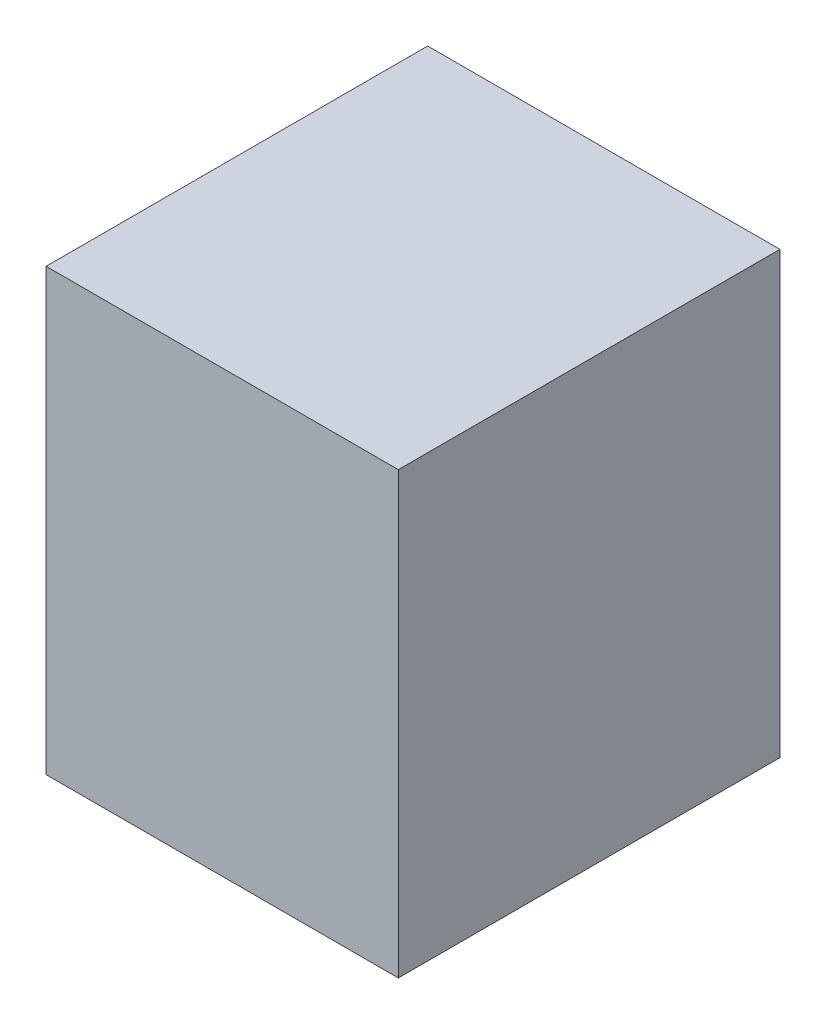
ISO-10303-21;
HEADER;
FILE_DESCRIPTION(('STEP AP214'),'2;1');
FILE_NAME('part.step','',(''),(''),'','','');
FILE_SCHEMA(('AUTOMOTIVE_DESIGN { 1 0 10303 214 1 1 1 1 }'));
ENDSEC;
DATA;
#1=APPLICATION_CONTEXT('core data for automotive mechanical design processes');
#2=APPLICATION_PROTOCOL_DEFINITION('international standard','automotive_design',2000,#1);
#3=PRODUCT_CONTEXT('',#1,'mechanical');
#4=PRODUCT('Part','Part','',(#3));
#5=PRODUCT_RELATED_PRODUCT_CATEGORY('part','',(#4));
#6=PRODUCT_DEFINITION_FORMATION('','',#4);
#7=PRODUCT_DEFINITION_CONTEXT('part definition',#1,'design');
#8=PRODUCT_DEFINITION('design','',#6,#7);
#9=PRODUCT_DEFINITION_SHAPE('','',#8);
#10=(LENGTH_UNIT() NAMED_UNIT(*) SI_UNIT(.MILLI.,.METRE.));
#11=(NAMED_UNIT(*) PLANE_ANGLE_UNIT() SI_UNIT($,.RADIAN.));
#12=(NAMED_UNIT(*) SI_UNIT($,.STERADIAN.) SOLID_ANGLE_UNIT());
#13=UNCERTAINTY_MEASURE_WITH_UNIT(LENGTH_MEASURE(1.E-05),#10,'distance_accuracy_value','');
#14=(GEOMETRIC_REPRESENTATION_CONTEXT(3) GLOBAL_UNCERTAINTY_ASSIGNED_CONTEXT((#13)) GLOBAL_UNIT_ASSIGNED_CONTEXT((#10,
#11,#12)) REPRESENTATION_CONTEXT('',''));
#15=CARTESIAN_POINT('',(0.,0.,0.));
#16=DIRECTION('',(0.,0.,1.));
#17=DIRECTION('',(1.,0.,0.));
#18=AXIS2_PLACEMENT_3D('',#15,#16,#17);
#19=CARTESIAN_POINT('',(-6.,-7.5,13.));
#20=DIRECTION('',(0.,1.,0.));
#21=DIRECTION('',(0.,0.,1.));
#22=AXIS2_PLACEMENT_3D('',#19,#20,#21);
#23=PLANE('',#22);
#24=DIRECTION('',(0.,0.,-1.));
#25=VECTOR('',#24,1.);
#26=CARTESIAN_POINT('',(5.05121444599866,-7.49999999999999,8.));
#27=LINE('',#26,#25);
#28=CARTESIAN_POINT('',(5.05121444599866,-7.49999999999999,8.));
#29=VERTEX_POINT('',#28);
#30=CARTESIAN_POINT('',(5.05121444599866,-7.49999999999999,0.));
#31=VERTEX_POINT('',#30);
#32=EDGE_CURVE('E173',#29,#31,#27,.T.);
#33=ORIENTED_EDGE('',*,*,#32,.T.);
#34=DIRECTION('',(1.,0.,0.));
#35=VECTOR('',#34,1.);
#36=CARTESIAN_POINT('',(-6.,-7.5,0.));
#37=LINE('',#36,#35);
#38=CARTESIAN_POINT('',(6.,-7.5,0.));
#39=VERTEX_POINT('',#38);
#40=EDGE_CURVE('E78',#31,#39,#37,.T.);
#41=ORIENTED_EDGE('',*,*,#40,.T.);
#42=DIRECTION('',(0.,0.,-1.));
#43=VECTOR('',#42,1.);
#44=CARTESIAN_POINT('',(6.,-7.5,13.));
#45=LINE('',#44,#43);
#46=CARTESIAN_POINT('',(6.,-7.5,13.));
#47=VERTEX_POINT('',#46);
#48=EDGE_CURVE('E195',#47,#39,#45,.T.);
#49=ORIENTED_EDGE('',*,*,#48,.F.);
#50=DIRECTION('',(1.,0.,0.));
#51=VECTOR('',#50,1.);
#52=CARTESIAN_POINT('',(-6.,-7.5,13.));
#53=LINE('',#52,#51);
#54=CARTESIAN_POINT('',(-6.,-7.5,13.));
#55=VERTEX_POINT('',#54);
#56=EDGE_CURVE('E57',#55,#47,#53,.T.);
#57=ORIENTED_EDGE('',*,*,#56,.F.);
#58=DIRECTION('',(0.,0.,-1.));
#59=VECTOR('',#58,1.);
#60=CARTESIAN_POINT('',(-6.,-7.5,13.));
#61=LINE('',#60,#59);
#62=CARTESIAN_POINT('',(-6.,-7.5,0.));
#63=VERTEX_POINT('',#62);
#64=EDGE_CURVE('E203',#55,#63,#61,.T.);
#65=ORIENTED_EDGE('',*,*,#64,.T.);
#66=CARTESIAN_POINT('',(-5.05121444599865,-7.5,0.));
#67=VERTEX_POINT('',#66);
#68=EDGE_CURVE('E191',#63,#67,#37,.T.);
#69=ORIENTED_EDGE('',*,*,#68,.T.);
#70=DIRECTION('',(0.,0.,-1.));
#71=VECTOR('',#70,1.);
#72=CARTESIAN_POINT('',(-5.05121444599865,-7.5,8.));
#73=LINE('',#72,#71);
#74=CARTESIAN_POINT('',(-5.05121444599865,-7.5,8.));
#75=VERTEX_POINT('',#74);
#76=EDGE_CURVE('E48',#75,#67,#73,.T.);
#77=ORIENTED_EDGE('',*,*,#76,.F.);
#78=DIRECTION('',(1.,0.,0.));
#79=VECTOR('',#78,1.);
#80=CARTESIAN_POINT('',(-5.05121444599865,-7.5,8.));
#81=LINE('',#80,#79);
#82=EDGE_CURVE('E245',#75,#29,#81,.T.);
#83=ORIENTED_EDGE('',*,*,#82,.T.);
#84=EDGE_LOOP('',(#33,#41,#49,#57,#65,#69,#77,#83));
#85=FACE_BOUND('',#84,.T.);
#86=ADVANCED_FACE('F33',(#85),#23,.F.);
#87=CARTESIAN_POINT('',(0.,0.,0.));
#88=DIRECTION('',(0.,0.,1.));
#89=DIRECTION('',(1.,0.,0.));
#90=AXIS2_PLACEMENT_3D('',#87,#88,#89);
#91=PLANE('',#90);
#92=DIRECTION('',(0.,1.,0.));
#93=VECTOR('',#92,1.);
#94=CARTESIAN_POINT('',(5.05121444599865,4.19782395760038,0.));
#95=LINE('',#94,#93);
#96=CARTESIAN_POINT('',(5.05121444599865,4.19782395760038,0.));
#97=VERTEX_POINT('',#96);
#98=EDGE_CURVE('E239',#31,#97,#95,.T.);
#99=ORIENTED_EDGE('',*,*,#98,.T.);
#100=DIRECTION('',(-1.,0.,0.));
#101=VECTOR('',#100,1.);
#102=CARTESIAN_POINT('',(2.94980673245959,4.19782395760038,0.));
#103=LINE('',#102,#101);
#104=CARTESIAN_POINT('',(2.94980673245959,4.19782395760038,0.));
#105=VERTEX_POINT('',#104);
#106=EDGE_CURVE('E178',#97,#105,#103,.T.);
#107=ORIENTED_EDGE('',*,*,#106,.T.);
#108=DIRECTION('',(0.,1.,0.));
#109=VECTOR('',#108,1.);
#110=CARTESIAN_POINT('',(2.94980673245959,5.67403113452869,0.));
#111=LINE('',#110,#109);
#112=CARTESIAN_POINT('',(2.94980673245959,5.67403113452869,0.));
#113=VERTEX_POINT('',#112);
#114=EDGE_CURVE('E242',#105,#113,#111,.T.);
#115=ORIENTED_EDGE('',*,*,#114,.T.);
#116=DIRECTION('',(-1.,0.,0.));
#117=VECTOR('',#116,1.);
#118=CARTESIAN_POINT('',(1.33126831185848,5.67403113452869,0.));
#119=LINE('',#118,#117);
#120=CARTESIAN_POINT('',(1.33126831185848,5.67403113452869,0.));
#121=VERTEX_POINT('',#120);
#122=EDGE_CURVE('E249',#113,#121,#119,.T.);
#123=ORIENTED_EDGE('',*,*,#122,.T.);
#124=DIRECTION('',(0.,1.,0.));
#125=VECTOR('',#124,1.);
#126=CARTESIAN_POINT('',(1.33126831185848,6.43495231548741,0.));
#127=LINE('',#126,#125);
#128=CARTESIAN_POINT('',(1.33126831185848,6.43495231548741,0.));
#129=VERTEX_POINT('',#128);
#130=EDGE_CURVE('E252',#121,#129,#127,.T.);
#131=ORIENTED_EDGE('',*,*,#130,.T.);
#132=DIRECTION('',(-1.,0.,0.));
#133=VECTOR('',#132,1.);
#134=CARTESIAN_POINT('',(1.33126831185848,6.43495231548741,0.));
#135=LINE('',#134,#133);
#136=CARTESIAN_POINT('',(-1.33126831185848,6.43495231548741,0.));
#137=VERTEX_POINT('',#136);
#138=EDGE_CURVE('E255',#129,#137,#135,.T.);
#139=ORIENTED_EDGE('',*,*,#138,.T.);
#140=DIRECTION('',(0.,-1.,0.));
#141=VECTOR('',#140,1.);
#142=CARTESIAN_POINT('',(-1.33126831185848,6.43495231548741,0.));
#143=LINE('',#142,#141);
#144=CARTESIAN_POINT('',(-1.33126831185848,5.67403113452869,0.));
#145=VERTEX_POINT('',#144);
#146=EDGE_CURVE('E258',#137,#145,#143,.T.);
#147=ORIENTED_EDGE('',*,*,#146,.T.);
#148=DIRECTION('',(-1.,0.,0.));
#149=VECTOR('',#148,1.);
#150=CARTESIAN_POINT('',(-1.33126831185848,5.67403113452869,0.));
#151=LINE('',#150,#149);
#152=CARTESIAN_POINT('',(-2.94980673245959,5.67403113452869,0.));
#153=VERTEX_POINT('',#152);
#154=EDGE_CURVE('E261',#145,#153,#151,.T.);
#155=ORIENTED_EDGE('',*,*,#154,.T.);
#156=DIRECTION('',(0.,-1.,0.));
#157=VECTOR('',#156,1.);
#158=CARTESIAN_POINT('',(-2.94980673245959,5.67403113452869,0.));
#159=LINE('',#158,#157);
#160=CARTESIAN_POINT('',(-2.94980673245959,4.19782395760038,0.));
#161=VERTEX_POINT('',#160);
#162=EDGE_CURVE('E264',#153,#161,#159,.T.);
#163=ORIENTED_EDGE('',*,*,#162,.T.);
#164=DIRECTION('',(-1.,0.,0.));
#165=VECTOR('',#164,1.);
#166=CARTESIAN_POINT('',(-2.94980673245959,4.19782395760038,0.));
#167=LINE('',#166,#165);
#168=CARTESIAN_POINT('',(-5.05121444599865,4.19782395760038,0.));
#169=VERTEX_POINT('',#168);
#170=EDGE_CURVE('E267',#161,#169,#167,.T.);
#171=ORIENTED_EDGE('',*,*,#170,.T.);
#172=DIRECTION('',(0.,-1.,0.));
#173=VECTOR('',#172,1.);
#174=CARTESIAN_POINT('',(-5.05121444599865,4.19782395760038,0.));
#175=LINE('',#174,#173);
#176=EDGE_CURVE('E174',#169,#67,#175,.T.);
#177=ORIENTED_EDGE('',*,*,#176,.T.);
#178=ORIENTED_EDGE('',*,*,#68,.F.);
#179=DIRECTION('',(0.,-1.,0.));
#180=VECTOR('',#179,1.);
#181=CARTESIAN_POINT('',(-6.,7.5,0.));
#182=LINE('',#181,#180);
#183=CARTESIAN_POINT('',(-6.,7.5,0.));
#184=VERTEX_POINT('',#183);
#185=EDGE_CURVE('E198',#184,#63,#182,.T.);
#186=ORIENTED_EDGE('',*,*,#185,.F.);
#187=DIRECTION('',(-1.,0.,0.));
#188=VECTOR('',#187,1.);
#189=CARTESIAN_POINT('',(-6.,7.5,0.));
#190=LINE('',#189,#188);
#191=CARTESIAN_POINT('',(6.,7.5,0.));
#192=VERTEX_POINT('',#191);
#193=EDGE_CURVE('E183',#192,#184,#190,.T.);
#194=ORIENTED_EDGE('',*,*,#193,.F.);
#195=DIRECTION('',(0.,1.,0.));
#196=VECTOR('',#195,1.);
#197=CARTESIAN_POINT('',(6.,7.5,0.));
#198=LINE('',#197,#196);
#199=EDGE_CURVE('E179',#39,#192,#198,.T.);
#200=ORIENTED_EDGE('',*,*,#199,.F.);
#201=ORIENTED_EDGE('',*,*,#40,.F.);
#202=EDGE_LOOP('',(#99,#107,#115,#123,#131,#139,#147,#155,#163,#171,#177,#178,#186,#194,#200,#201));
#203=FACE_BOUND('',#202,.T.);
#204=ADVANCED_FACE('F213',(#203),#91,.F.);
#205=CARTESIAN_POINT('',(6.,7.5,13.));
#206=DIRECTION('',(-1.,0.,0.));
#207=DIRECTION('',(0.,-1.,0.));
#208=AXIS2_PLACEMENT_3D('',#205,#206,#207);
#209=PLANE('',#208);
#210=ORIENTED_EDGE('',*,*,#199,.T.);
#211=DIRECTION('',(0.,0.,-1.));
#212=VECTOR('',#211,1.);
#213=CARTESIAN_POINT('',(6.,7.5,13.));
#214=LINE('',#213,#212);
#215=CARTESIAN_POINT('',(6.,7.5,13.));
#216=VERTEX_POINT('',#215);
#217=EDGE_CURVE('E11',#216,#192,#214,.T.);
#218=ORIENTED_EDGE('',*,*,#217,.F.);
#219=DIRECTION('',(0.,1.,0.));
#220=VECTOR('',#219,1.);
#221=CARTESIAN_POINT('',(6.,7.5,13.));
#222=LINE('',#221,#220);
#223=EDGE_CURVE('E189',#47,#216,#222,.T.);
#224=ORIENTED_EDGE('',*,*,#223,.F.);
#225=ORIENTED_EDGE('',*,*,#48,.T.);
#226=EDGE_LOOP('',(#210,#218,#224,#225));
#227=FACE_BOUND('',#226,.T.);
#228=ADVANCED_FACE('F35',(#227),#209,.F.);
#229=CARTESIAN_POINT('',(-6.,7.5,13.));
#230=DIRECTION('',(0.,-1.,0.));
#231=DIRECTION('',(0.,0.,-1.));
#232=AXIS2_PLACEMENT_3D('',#229,#230,#231);
#233=PLANE('',#232);
#234=ORIENTED_EDGE('',*,*,#193,.T.);
#235=DIRECTION('',(0.,0.,-1.));
#236=VECTOR('',#235,1.);
#237=CARTESIAN_POINT('',(-6.,7.5,13.));
#238=LINE('',#237,#236);
#239=CARTESIAN_POINT('',(-6.,7.5,13.));
#240=VERTEX_POINT('',#239);
#241=EDGE_CURVE('E41',#240,#184,#238,.T.);
#242=ORIENTED_EDGE('',*,*,#241,.F.);
#243=DIRECTION('',(-1.,0.,0.));
#244=VECTOR('',#243,1.);
#245=CARTESIAN_POINT('',(-6.,7.5,13.));
#246=LINE('',#245,#244);
#247=EDGE_CURVE('E85',#216,#240,#246,.T.);
#248=ORIENTED_EDGE('',*,*,#247,.F.);
#249=ORIENTED_EDGE('',*,*,#217,.T.);
#250=EDGE_LOOP('',(#234,#242,#248,#249));
#251=FACE_BOUND('',#250,.T.);
#252=ADVANCED_FACE('F227',(#251),#233,.F.);
#253=CARTESIAN_POINT('',(-6.,7.5,13.));
#254=DIRECTION('',(1.,0.,0.));
#255=DIRECTION('',(0.,1.,0.));
#256=AXIS2_PLACEMENT_3D('',#253,#254,#255);
#257=PLANE('',#256);
#258=ORIENTED_EDGE('',*,*,#185,.T.);
#259=ORIENTED_EDGE('',*,*,#64,.F.);
#260=DIRECTION('',(0.,-1.,0.));
#261=VECTOR('',#260,1.);
#262=CARTESIAN_POINT('',(-6.,7.5,13.));
#263=LINE('',#262,#261);
#264=EDGE_CURVE('E193',#240,#55,#263,.T.);
#265=ORIENTED_EDGE('',*,*,#264,.F.);
#266=ORIENTED_EDGE('',*,*,#241,.T.);
#267=EDGE_LOOP('',(#258,#259,#265,#266));
#268=FACE_BOUND('',#267,.T.);
#269=ADVANCED_FACE('F209',(#268),#257,.F.);
#270=CARTESIAN_POINT('',(0.,0.,13.));
#271=DIRECTION('',(0.,0.,1.));
#272=DIRECTION('',(1.,0.,0.));
#273=AXIS2_PLACEMENT_3D('',#270,#271,#272);
#274=PLANE('',#273);
#275=ORIENTED_EDGE('',*,*,#223,.T.);
#276=ORIENTED_EDGE('',*,*,#247,.T.);
#277=ORIENTED_EDGE('',*,*,#264,.T.);
#278=ORIENTED_EDGE('',*,*,#56,.T.);
#279=EDGE_LOOP('',(#275,#276,#277,#278));
#280=FACE_BOUND('',#279,.T.);
#281=ADVANCED_FACE('F219',(#280),#274,.T.);
#282=CARTESIAN_POINT('',(5.05121444599865,4.19782395760038,8.));
#283=DIRECTION('',(-1.,0.,0.));
#284=DIRECTION('',(0.,-1.,0.));
#285=AXIS2_PLACEMENT_3D('',#282,#283,#284);
#286=PLANE('',#285);
#287=ORIENTED_EDGE('',*,*,#98,.F.);
#288=ORIENTED_EDGE('',*,*,#32,.F.);
#289=DIRECTION('',(0.,1.,0.));
#290=VECTOR('',#289,1.);
#291=CARTESIAN_POINT('',(5.05121444599865,4.19782395760038,8.));
#292=LINE('',#291,#290);
#293=CARTESIAN_POINT('',(5.05121444599865,4.19782395760038,8.));
#294=VERTEX_POINT('',#293);
#295=EDGE_CURVE('E160',#29,#294,#292,.T.);
#296=ORIENTED_EDGE('',*,*,#295,.T.);
#297=DIRECTION('',(0.,0.,-1.));
#298=VECTOR('',#297,1.);
#299=CARTESIAN_POINT('',(5.05121444599865,4.19782395760038,8.));
#300=LINE('',#299,#298);
#301=EDGE_CURVE('E171',#294,#97,#300,.T.);
#302=ORIENTED_EDGE('',*,*,#301,.T.);
#303=EDGE_LOOP('',(#287,#288,#296,#302));
#304=FACE_BOUND('',#303,.T.);
#305=ADVANCED_FACE('F170',(#304),#286,.T.);
#306=CARTESIAN_POINT('',(2.94980673245959,4.19782395760038,8.));
#307=DIRECTION('',(0.,-1.,0.));
#308=DIRECTION('',(0.,0.,-1.));
#309=AXIS2_PLACEMENT_3D('',#306,#307,#308);
#310=PLANE('',#309);
#311=ORIENTED_EDGE('',*,*,#106,.F.);
#312=ORIENTED_EDGE('',*,*,#301,.F.);
#313=DIRECTION('',(-1.,0.,0.));
#314=VECTOR('',#313,1.);
#315=CARTESIAN_POINT('',(2.94980673245959,4.19782395760038,8.));
#316=LINE('',#315,#314);
#317=CARTESIAN_POINT('',(2.94980673245959,4.19782395760038,8.));
#318=VERTEX_POINT('',#317);
#319=EDGE_CURVE('E156',#294,#318,#316,.T.);
#320=ORIENTED_EDGE('',*,*,#319,.T.);
#321=DIRECTION('',(0.,0.,-1.));
#322=VECTOR('',#321,1.);
#323=CARTESIAN_POINT('',(2.94980673245959,4.19782395760038,8.));
#324=LINE('',#323,#322);
#325=EDGE_CURVE('E180',#318,#105,#324,.T.);
#326=ORIENTED_EDGE('',*,*,#325,.T.);
#327=EDGE_LOOP('',(#311,#312,#320,#326));
#328=FACE_BOUND('',#327,.T.);
#329=ADVANCED_FACE('F176',(#328),#310,.T.);
#330=CARTESIAN_POINT('',(2.94980673245959,5.67403113452869,8.));
#331=DIRECTION('',(-1.,0.,0.));
#332=DIRECTION('',(0.,-1.,0.));
#333=AXIS2_PLACEMENT_3D('',#330,#331,#332);
#334=PLANE('',#333);
#335=ORIENTED_EDGE('',*,*,#114,.F.);
#336=ORIENTED_EDGE('',*,*,#325,.F.);
#337=DIRECTION('',(0.,1.,0.));
#338=VECTOR('',#337,1.);
#339=CARTESIAN_POINT('',(2.94980673245959,5.67403113452869,8.));
#340=LINE('',#339,#338);
#341=CARTESIAN_POINT('',(2.94980673245959,5.67403113452869,8.));
#342=VERTEX_POINT('',#341);
#343=EDGE_CURVE('E163',#318,#342,#340,.T.);
#344=ORIENTED_EDGE('',*,*,#343,.T.);
#345=DIRECTION('',(0.,0.,-1.));
#346=VECTOR('',#345,1.);
#347=CARTESIAN_POINT('',(2.94980673245959,5.67403113452869,8.));
#348=LINE('',#347,#346);
#349=EDGE_CURVE('E185',#342,#113,#348,.T.);
#350=ORIENTED_EDGE('',*,*,#349,.T.);
#351=EDGE_LOOP('',(#335,#336,#344,#350));
#352=FACE_BOUND('',#351,.T.);
#353=ADVANCED_FACE('F289',(#352),#334,.T.);
#354=CARTESIAN_POINT('',(1.33126831185848,5.67403113452869,8.));
#355=DIRECTION('',(0.,-1.,0.));
#356=DIRECTION('',(0.,0.,-1.));
#357=AXIS2_PLACEMENT_3D('',#354,#355,#356);
#358=PLANE('',#357);
#359=ORIENTED_EDGE('',*,*,#122,.F.);
#360=ORIENTED_EDGE('',*,*,#349,.F.);
#361=DIRECTION('',(-1.,0.,0.));
#362=VECTOR('',#361,1.);
#363=CARTESIAN_POINT('',(1.33126831185848,5.67403113452869,8.));
#364=LINE('',#363,#362);
#365=CARTESIAN_POINT('',(1.33126831185848,5.67403113452869,8.));
#366=VERTEX_POINT('',#365);
#367=EDGE_CURVE('E463',#342,#366,#364,.T.);
#368=ORIENTED_EDGE('',*,*,#367,.T.);
#369=DIRECTION('',(0.,0.,-1.));
#370=VECTOR('',#369,1.);
#371=CARTESIAN_POINT('',(1.33126831185848,5.67403113452869,8.));
#372=LINE('',#371,#370);
#373=EDGE_CURVE('E284',#366,#121,#372,.T.);
#374=ORIENTED_EDGE('',*,*,#373,.T.);
#375=EDGE_LOOP('',(#359,#360,#368,#374));
#376=FACE_BOUND('',#375,.T.);
#377=ADVANCED_FACE('F291',(#376),#358,.T.);
#378=CARTESIAN_POINT('',(1.33126831185848,6.43495231548741,8.));
#379=DIRECTION('',(-1.,0.,0.));
#380=DIRECTION('',(0.,0.,1.));
#381=AXIS2_PLACEMENT_3D('',#378,#379,#380);
#382=PLANE('',#381);
#383=ORIENTED_EDGE('',*,*,#130,.F.);
#384=ORIENTED_EDGE('',*,*,#373,.F.);
#385=DIRECTION('',(0.,1.,0.));
#386=VECTOR('',#385,1.);
#387=CARTESIAN_POINT('',(1.33126831185848,6.43495231548741,8.));
#388=LINE('',#387,#386);
#389=CARTESIAN_POINT('',(1.33126831185848,6.43495231548741,8.));
#390=VERTEX_POINT('',#389);
#391=EDGE_CURVE('E299',#366,#390,#388,.T.);
#392=ORIENTED_EDGE('',*,*,#391,.T.);
#393=DIRECTION('',(0.,0.,-1.));
#394=VECTOR('',#393,1.);
#395=CARTESIAN_POINT('',(1.33126831185848,6.43495231548741,8.));
#396=LINE('',#395,#394);
#397=EDGE_CURVE('E282',#390,#129,#396,.T.);
#398=ORIENTED_EDGE('',*,*,#397,.T.);
#399=EDGE_LOOP('',(#383,#384,#392,#398));
#400=FACE_BOUND('',#399,.T.);
#401=ADVANCED_FACE('F296',(#400),#382,.T.);
#402=CARTESIAN_POINT('',(1.33126831185848,6.43495231548741,8.));
#403=DIRECTION('',(0.,-1.,0.));
#404=DIRECTION('',(0.,0.,-1.));
#405=AXIS2_PLACEMENT_3D('',#402,#403,#404);
#406=PLANE('',#405);
#407=ORIENTED_EDGE('',*,*,#138,.F.);
#408=ORIENTED_EDGE('',*,*,#397,.F.);
#409=DIRECTION('',(-1.,0.,0.));
#410=VECTOR('',#409,1.);
#411=CARTESIAN_POINT('',(1.33126831185848,6.43495231548741,8.));
#412=LINE('',#411,#410);
#413=CARTESIAN_POINT('',(-1.33126831185848,6.43495231548741,8.));
#414=VERTEX_POINT('',#413);
#415=EDGE_CURVE('E305',#390,#414,#412,.T.);
#416=ORIENTED_EDGE('',*,*,#415,.T.);
#417=DIRECTION('',(0.,0.,-1.));
#418=VECTOR('',#417,1.);
#419=CARTESIAN_POINT('',(-1.33126831185848,6.43495231548741,8.));
#420=LINE('',#419,#418);
#421=EDGE_CURVE('E280',#414,#137,#420,.T.);
#422=ORIENTED_EDGE('',*,*,#421,.T.);
#423=EDGE_LOOP('',(#407,#408,#416,#422));
#424=FACE_BOUND('',#423,.T.);
#425=ADVANCED_FACE('F302',(#424),#406,.T.);
#426=CARTESIAN_POINT('',(-1.33126831185848,6.43495231548741,8.));
#427=DIRECTION('',(1.,0.,0.));
#428=DIRECTION('',(0.,0.,-1.));
#429=AXIS2_PLACEMENT_3D('',#426,#427,#428);
#430=PLANE('',#429);
#431=ORIENTED_EDGE('',*,*,#146,.F.);
#432=ORIENTED_EDGE('',*,*,#421,.F.);
#433=DIRECTION('',(0.,-1.,0.));
#434=VECTOR('',#433,1.);
#435=CARTESIAN_POINT('',(-1.33126831185848,6.43495231548741,8.));
#436=LINE('',#435,#434);
#437=CARTESIAN_POINT('',(-1.33126831185848,5.67403113452869,8.));
#438=VERTEX_POINT('',#437);
#439=EDGE_CURVE('E459',#414,#438,#436,.T.);
#440=ORIENTED_EDGE('',*,*,#439,.T.);
#441=DIRECTION('',(0.,0.,-1.));
#442=VECTOR('',#441,1.);
#443=CARTESIAN_POINT('',(-1.33126831185848,5.67403113452869,8.));
#444=LINE('',#443,#442);
#445=EDGE_CURVE('E278',#438,#145,#444,.T.);
#446=ORIENTED_EDGE('',*,*,#445,.T.);
#447=EDGE_LOOP('',(#431,#432,#440,#446));
#448=FACE_BOUND('',#447,.T.);
#449=ADVANCED_FACE('F308',(#448),#430,.T.);
#450=CARTESIAN_POINT('',(-1.33126831185848,5.67403113452869,8.));
#451=DIRECTION('',(0.,-1.,0.));
#452=DIRECTION('',(0.,0.,-1.));
#453=AXIS2_PLACEMENT_3D('',#450,#451,#452);
#454=PLANE('',#453);
#455=ORIENTED_EDGE('',*,*,#154,.F.);
#456=ORIENTED_EDGE('',*,*,#445,.F.);
#457=DIRECTION('',(-1.,0.,0.));
#458=VECTOR('',#457,1.);
#459=CARTESIAN_POINT('',(-1.33126831185848,5.67403113452869,8.));
#460=LINE('',#459,#458);
#461=CARTESIAN_POINT('',(-2.94980673245959,5.67403113452869,8.));
#462=VERTEX_POINT('',#461);
#463=EDGE_CURVE('E316',#438,#462,#460,.T.);
#464=ORIENTED_EDGE('',*,*,#463,.T.);
#465=DIRECTION('',(0.,0.,-1.));
#466=VECTOR('',#465,1.);
#467=CARTESIAN_POINT('',(-2.94980673245959,5.67403113452869,8.));
#468=LINE('',#467,#466);
#469=EDGE_CURVE('E276',#462,#153,#468,.T.);
#470=ORIENTED_EDGE('',*,*,#469,.T.);
#471=EDGE_LOOP('',(#455,#456,#464,#470));
#472=FACE_BOUND('',#471,.T.);
#473=ADVANCED_FACE('F313',(#472),#454,.T.);
#474=CARTESIAN_POINT('',(-2.94980673245959,5.67403113452869,8.));
#475=DIRECTION('',(1.,0.,0.));
#476=DIRECTION('',(0.,0.,-1.));
#477=AXIS2_PLACEMENT_3D('',#474,#475,#476);
#478=PLANE('',#477);
#479=ORIENTED_EDGE('',*,*,#162,.F.);
#480=ORIENTED_EDGE('',*,*,#469,.F.);
#481=DIRECTION('',(0.,-1.,0.));
#482=VECTOR('',#481,1.);
#483=CARTESIAN_POINT('',(-2.94980673245959,5.67403113452869,8.));
#484=LINE('',#483,#482);
#485=CARTESIAN_POINT('',(-2.94980673245959,4.19782395760038,8.));
#486=VERTEX_POINT('',#485);
#487=EDGE_CURVE('E322',#462,#486,#484,.T.);
#488=ORIENTED_EDGE('',*,*,#487,.T.);
#489=DIRECTION('',(0.,0.,-1.));
#490=VECTOR('',#489,1.);
#491=CARTESIAN_POINT('',(-2.94980673245959,4.19782395760038,8.));
#492=LINE('',#491,#490);
#493=EDGE_CURVE('E274',#486,#161,#492,.T.);
#494=ORIENTED_EDGE('',*,*,#493,.T.);
#495=EDGE_LOOP('',(#479,#480,#488,#494));
#496=FACE_BOUND('',#495,.T.);
#497=ADVANCED_FACE('F319',(#496),#478,.T.);
#498=CARTESIAN_POINT('',(-2.94980673245959,4.19782395760038,8.));
#499=DIRECTION('',(0.,-1.,0.));
#500=DIRECTION('',(0.,0.,-1.));
#501=AXIS2_PLACEMENT_3D('',#498,#499,#500);
#502=PLANE('',#501);
#503=ORIENTED_EDGE('',*,*,#170,.F.);
#504=ORIENTED_EDGE('',*,*,#493,.F.);
#505=DIRECTION('',(-1.,0.,0.));
#506=VECTOR('',#505,1.);
#507=CARTESIAN_POINT('',(-2.94980673245959,4.19782395760038,8.));
#508=LINE('',#507,#506);
#509=CARTESIAN_POINT('',(-5.05121444599865,4.19782395760038,8.));
#510=VERTEX_POINT('',#509);
#511=EDGE_CURVE('E327',#486,#510,#508,.T.);
#512=ORIENTED_EDGE('',*,*,#511,.T.);
#513=DIRECTION('',(0.,0.,-1.));
#514=VECTOR('',#513,1.);
#515=CARTESIAN_POINT('',(-5.05121444599865,4.19782395760038,8.));
#516=LINE('',#515,#514);
#517=EDGE_CURVE('E272',#510,#169,#516,.T.);
#518=ORIENTED_EDGE('',*,*,#517,.T.);
#519=EDGE_LOOP('',(#503,#504,#512,#518));
#520=FACE_BOUND('',#519,.T.);
#521=ADVANCED_FACE('F325',(#520),#502,.T.);
#522=CARTESIAN_POINT('',(-5.05121444599865,4.19782395760038,8.));
#523=DIRECTION('',(1.,0.,0.));
#524=DIRECTION('',(0.,0.,-1.));
#525=AXIS2_PLACEMENT_3D('',#522,#523,#524);
#526=PLANE('',#525);
#527=ORIENTED_EDGE('',*,*,#176,.F.);
#528=ORIENTED_EDGE('',*,*,#517,.F.);
#529=DIRECTION('',(0.,-1.,0.));
#530=VECTOR('',#529,1.);
#531=CARTESIAN_POINT('',(-5.05121444599865,4.19782395760038,8.));
#532=LINE('',#531,#530);
#533=EDGE_CURVE('E454',#510,#75,#532,.T.);
#534=ORIENTED_EDGE('',*,*,#533,.T.);
#535=ORIENTED_EDGE('',*,*,#76,.T.);
#536=EDGE_LOOP('',(#527,#528,#534,#535));
#537=FACE_BOUND('',#536,.T.);
#538=ADVANCED_FACE('F329',(#537),#526,.T.);
#539=CARTESIAN_POINT('',(0.,0.,8.));
#540=DIRECTION('',(0.,0.,1.));
#541=DIRECTION('',(1.,0.,0.));
#542=AXIS2_PLACEMENT_3D('',#539,#540,#541);
#543=PLANE('',#542);
#544=ORIENTED_EDGE('',*,*,#295,.F.);
#545=ORIENTED_EDGE('',*,*,#82,.F.);
#546=ORIENTED_EDGE('',*,*,#533,.F.);
#547=ORIENTED_EDGE('',*,*,#511,.F.);
#548=ORIENTED_EDGE('',*,*,#487,.F.);
#549=ORIENTED_EDGE('',*,*,#463,.F.);
#550=ORIENTED_EDGE('',*,*,#439,.F.);
#551=ORIENTED_EDGE('',*,*,#415,.F.);
#552=ORIENTED_EDGE('',*,*,#391,.F.);
#553=ORIENTED_EDGE('',*,*,#367,.F.);
#554=ORIENTED_EDGE('',*,*,#343,.F.);
#555=ORIENTED_EDGE('',*,*,#319,.F.);
#556=EDGE_LOOP('',(#544,#545,#546,#547,#548,#549,#550,#551,#552,#553,#554,#555));
#557=FACE_BOUND('',#556,.T.);
#558=ADVANCED_FACE('F158',(#557),#543,.F.);
#559=CLOSED_SHELL('',(#86,#204,#228,#252,#269,#281,#305,#329,#353,#377,#401,#425,#449,#473,#497,
#521,#538,#558));
#560=MANIFOLD_SOLID_BREP('B2',#559);
#561=ADVANCED_BREP_SHAPE_REPRESENTATION('',(#18,#560),#14);
#562=SHAPE_DEFINITION_REPRESENTATION(#9,#561);
ENDSEC;
END-ISO-10303-21;
